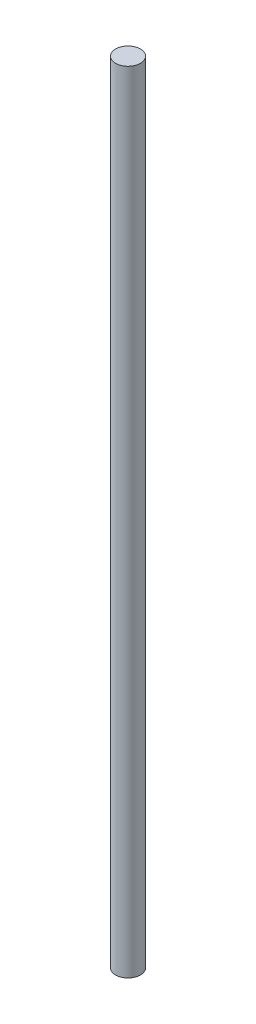
ISO-10303-21;
HEADER;
FILE_DESCRIPTION(('STEP AP214'),'2;1');
FILE_NAME('part.step','',(''),(''),'','','');
FILE_SCHEMA(('AUTOMOTIVE_DESIGN { 1 0 10303 214 1 1 1 1 }'));
ENDSEC;
DATA;
#1=APPLICATION_CONTEXT('core data for automotive mechanical design processes');
#2=APPLICATION_PROTOCOL_DEFINITION('international standard','automotive_design',2000,#1);
#3=PRODUCT_CONTEXT('',#1,'mechanical');
#4=PRODUCT('Part','Part','',(#3));
#5=PRODUCT_RELATED_PRODUCT_CATEGORY('part','',(#4));
#6=PRODUCT_DEFINITION_FORMATION('','',#4);
#7=PRODUCT_DEFINITION_CONTEXT('part definition',#1,'design');
#8=PRODUCT_DEFINITION('design','',#6,#7);
#9=PRODUCT_DEFINITION_SHAPE('','',#8);
#10=(LENGTH_UNIT() NAMED_UNIT(*) SI_UNIT(.MILLI.,.METRE.));
#11=(NAMED_UNIT(*) PLANE_ANGLE_UNIT() SI_UNIT($,.RADIAN.));
#12=(NAMED_UNIT(*) SI_UNIT($,.STERADIAN.) SOLID_ANGLE_UNIT());
#13=UNCERTAINTY_MEASURE_WITH_UNIT(LENGTH_MEASURE(1.E-05),#10,'distance_accuracy_value','');
#14=(GEOMETRIC_REPRESENTATION_CONTEXT(3) GLOBAL_UNCERTAINTY_ASSIGNED_CONTEXT((#13)) GLOBAL_UNIT_ASSIGNED_CONTEXT((#10,
#11,#12)) REPRESENTATION_CONTEXT('',''));
#15=CARTESIAN_POINT('',(0.,0.,0.));
#16=DIRECTION('',(0.,0.,1.));
#17=DIRECTION('',(1.,0.,0.));
#18=AXIS2_PLACEMENT_3D('',#15,#16,#17);
#19=CARTESIAN_POINT('',(0.,254.,0.));
#20=DIRECTION('',(0.,-1.,0.));
#21=DIRECTION('',(0.,0.,1.));
#22=AXIS2_PLACEMENT_3D('',#19,#20,#21);
#23=CYLINDRICAL_SURFACE('',#22,4.);
#24=CARTESIAN_POINT('',(0.,254.,0.));
#25=DIRECTION('',(0.,-1.,0.));
#26=DIRECTION('',(0.,0.,-1.));
#27=AXIS2_PLACEMENT_3D('',#24,#25,#26);
#28=CIRCLE('',#27,4.);
#29=CARTESIAN_POINT('',(0.,254.,-4.));
#30=VERTEX_POINT('',#29);
#31=EDGE_CURVE('E10',#30,#30,#28,.T.);
#32=ORIENTED_EDGE('',*,*,#31,.T.);
#33=EDGE_LOOP('',(#32));
#34=FACE_BOUND('',#33,.T.);
#35=CARTESIAN_POINT('',(0.,0.,0.));
#36=DIRECTION('',(0.,-1.,0.));
#37=DIRECTION('',(0.,0.,-1.));
#38=AXIS2_PLACEMENT_3D('',#35,#36,#37);
#39=CIRCLE('',#38,4.);
#40=CARTESIAN_POINT('',(0.,0.,-4.));
#41=VERTEX_POINT('',#40);
#42=EDGE_CURVE('E38',#41,#41,#39,.T.);
#43=ORIENTED_EDGE('',*,*,#42,.F.);
#44=EDGE_LOOP('',(#43));
#45=FACE_BOUND('',#44,.T.);
#46=ADVANCED_FACE('F35',(#34,#45),#23,.T.);
#47=CARTESIAN_POINT('',(0.,254.,0.));
#48=DIRECTION('',(0.,1.,0.));
#49=DIRECTION('',(0.,0.,-1.));
#50=AXIS2_PLACEMENT_3D('',#47,#48,#49);
#51=PLANE('',#50);
#52=ORIENTED_EDGE('',*,*,#31,.F.);
#53=EDGE_LOOP('',(#52));
#54=FACE_BOUND('',#53,.T.);
#55=ADVANCED_FACE('F50',(#54),#51,.T.);
#56=CARTESIAN_POINT('',(0.,0.,0.));
#57=DIRECTION('',(0.,1.,0.));
#58=DIRECTION('',(0.,0.,-1.));
#59=AXIS2_PLACEMENT_3D('',#56,#57,#58);
#60=PLANE('',#59);
#61=ORIENTED_EDGE('',*,*,#42,.T.);
#62=EDGE_LOOP('',(#61));
#63=FACE_BOUND('',#62,.T.);
#64=ADVANCED_FACE('F47',(#63),#60,.F.);
#65=CLOSED_SHELL('',(#46,#55,#64));
#66=MANIFOLD_SOLID_BREP('B2',#65);
#67=ADVANCED_BREP_SHAPE_REPRESENTATION('',(#18,#66),#14);
#68=SHAPE_DEFINITION_REPRESENTATION(#9,#67);
ENDSEC;
END-ISO-10303-21;
